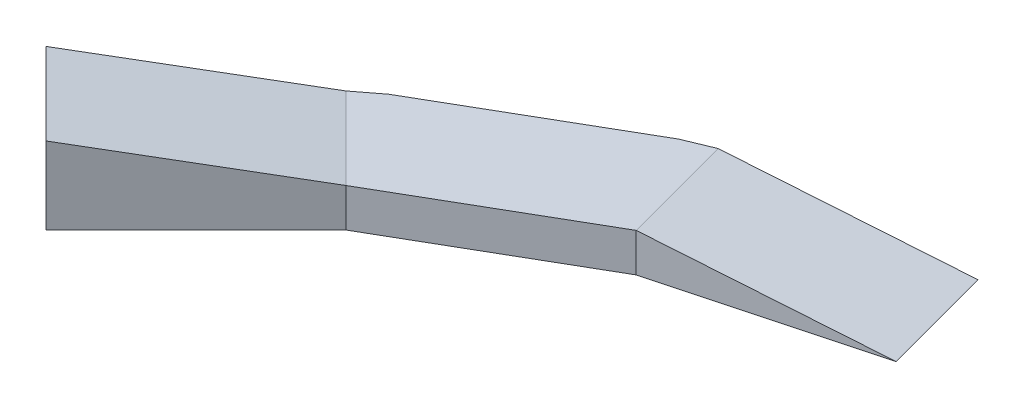
ISO-10303-21;
HEADER;
FILE_DESCRIPTION(('STEP AP214'),'2;1');
FILE_NAME('part.step','',(''),(''),'','','');
FILE_SCHEMA(('AUTOMOTIVE_DESIGN { 1 0 10303 214 1 1 1 1 }'));
ENDSEC;
DATA;
#1=APPLICATION_CONTEXT('core data for automotive mechanical design processes');
#2=APPLICATION_PROTOCOL_DEFINITION('international standard','automotive_design',2000,#1);
#3=PRODUCT_CONTEXT('',#1,'mechanical');
#4=PRODUCT('Part','Part','',(#3));
#5=PRODUCT_RELATED_PRODUCT_CATEGORY('part','',(#4));
#6=PRODUCT_DEFINITION_FORMATION('','',#4);
#7=PRODUCT_DEFINITION_CONTEXT('part definition',#1,'design');
#8=PRODUCT_DEFINITION('design','',#6,#7);
#9=PRODUCT_DEFINITION_SHAPE('','',#8);
#10=(LENGTH_UNIT() NAMED_UNIT(*) SI_UNIT(.MILLI.,.METRE.));
#11=(NAMED_UNIT(*) PLANE_ANGLE_UNIT() SI_UNIT($,.RADIAN.));
#12=(NAMED_UNIT(*) SI_UNIT($,.STERADIAN.) SOLID_ANGLE_UNIT());
#13=UNCERTAINTY_MEASURE_WITH_UNIT(LENGTH_MEASURE(1.E-05),#10,'distance_accuracy_value','');
#14=(GEOMETRIC_REPRESENTATION_CONTEXT(3) GLOBAL_UNCERTAINTY_ASSIGNED_CONTEXT((#13)) GLOBAL_UNIT_ASSIGNED_CONTEXT((#10,
#11,#12)) REPRESENTATION_CONTEXT('',''));
#15=CARTESIAN_POINT('',(0.,0.,0.));
#16=DIRECTION('',(0.,0.,1.));
#17=DIRECTION('',(1.,0.,0.));
#18=AXIS2_PLACEMENT_3D('',#15,#16,#17);
#19=CARTESIAN_POINT('',(-3315.1463530809,-600.,315.085707342127));
#20=DIRECTION('',(-0.608761429008751,0.,-0.793353340291212));
#21=DIRECTION('',(-0.793353340291212,0.,0.608761429008751));
#22=AXIS2_PLACEMENT_3D('',#19,#20,#21);
#23=PLANE('',#22);
#24=DIRECTION('',(0.,1.,0.));
#25=VECTOR('',#24,1.);
#26=CARTESIAN_POINT('',(-3439.41042179279,-600.,410.436880900838));
#27=LINE('',#26,#25);
#28=CARTESIAN_POINT('',(-3439.41042179279,-600.,410.436880900838));
#29=VERTEX_POINT('',#28);
#30=CARTESIAN_POINT('',(-3439.41042179279,-400.,410.436880900831));
#31=VERTEX_POINT('',#30);
#32=EDGE_CURVE('E132',#29,#31,#27,.T.);
#33=ORIENTED_EDGE('',*,*,#32,.T.);
#34=DIRECTION('',(-0.793353340291213,0.,0.60876142900875));
#35=VECTOR('',#34,1.);
#36=CARTESIAN_POINT('',(-3315.14635308086,-400.,315.085707342096));
#37=LINE('',#36,#35);
#38=CARTESIAN_POINT('',(-3315.14635308086,-400.,315.085707342096));
#39=VERTEX_POINT('',#38);
#40=EDGE_CURVE('E126',#39,#31,#37,.T.);
#41=ORIENTED_EDGE('',*,*,#40,.F.);
#42=DIRECTION('',(0.,1.,0.));
#43=VECTOR('',#42,1.);
#44=CARTESIAN_POINT('',(-3315.1463530809,-600.,315.085707342127));
#45=LINE('',#44,#43);
#46=CARTESIAN_POINT('',(-3315.1463530809,-600.,315.085707342127));
#47=VERTEX_POINT('',#46);
#48=EDGE_CURVE('E136',#47,#39,#45,.T.);
#49=ORIENTED_EDGE('',*,*,#48,.F.);
#50=DIRECTION('',(-0.793353340291212,0.,0.608761429008751));
#51=VECTOR('',#50,1.);
#52=CARTESIAN_POINT('',(-3315.1463530809,-600.,315.085707342127));
#53=LINE('',#52,#51);
#54=EDGE_CURVE('E165',#47,#29,#53,.T.);
#55=ORIENTED_EDGE('',*,*,#54,.T.);
#56=EDGE_LOOP('',(#33,#41,#49,#55));
#57=FACE_BOUND('',#56,.T.);
#58=ADVANCED_FACE('F34',(#57),#23,.T.);
#59=CARTESIAN_POINT('',(-1000.,-600.,1.22464679914735E-13));
#60=DIRECTION('',(0.258819045102515,0.,0.96592582628907));
#61=DIRECTION('',(0.96592582628907,0.,-0.258819045102515));
#62=AXIS2_PLACEMENT_3D('',#59,#60,#61);
#63=PLANE('',#62);
#64=DIRECTION('',(0.96592582628907,0.,-0.258819045102515));
#65=VECTOR('',#64,1.);
#66=CARTESIAN_POINT('',(-1000.,-600.,1.22464679914735E-13));
#67=LINE('',#66,#65);
#68=CARTESIAN_POINT('',(-2062.51840891798,-600.,284.700949612766));
#69=VERTEX_POINT('',#68);
#70=CARTESIAN_POINT('',(-1000.,-600.,1.22464679914735E-13));
#71=VERTEX_POINT('',#70);
#72=EDGE_CURVE('E147',#69,#71,#67,.T.);
#73=ORIENTED_EDGE('',*,*,#72,.T.);
#74=DIRECTION('',(-0.950345355874206,0.178885438199983,0.254644270637155));
#75=VECTOR('',#74,1.);
#76=CARTESIAN_POINT('',(-198.845471824454,-750.802945426876,-214.668708837169));
#77=LINE('',#76,#75);
#78=CARTESIAN_POINT('',(-2062.51840891798,-400.,284.700949612765));
#79=VERTEX_POINT('',#78);
#80=EDGE_CURVE('E182',#71,#79,#77,.T.);
#81=ORIENTED_EDGE('',*,*,#80,.T.);
#82=DIRECTION('',(0.,1.,0.));
#83=VECTOR('',#82,1.);
#84=CARTESIAN_POINT('',(-2062.51840891798,-600.,284.700949612766));
#85=LINE('',#84,#83);
#86=EDGE_CURVE('E11',#69,#79,#85,.T.);
#87=ORIENTED_EDGE('',*,*,#86,.F.);
#88=EDGE_LOOP('',(#73,#81,#87));
#89=FACE_BOUND('',#88,.T.);
#90=ADVANCED_FACE('F205',(#89),#63,.T.);
#91=CARTESIAN_POINT('',(-1155.29142706151,-600.,-579.55549577344));
#92=DIRECTION('',(-0.258819045102515,0.,-0.96592582628907));
#93=DIRECTION('',(-0.96592582628907,0.,0.258819045102515));
#94=AXIS2_PLACEMENT_3D('',#91,#92,#93);
#95=PLANE('',#94);
#96=DIRECTION('',(0.,1.,0.));
#97=VECTOR('',#96,1.);
#98=CARTESIAN_POINT('',(-2217.80983597949,-600.,-294.854546160674));
#99=LINE('',#98,#97);
#100=CARTESIAN_POINT('',(-2217.80983597949,-600.,-294.854546160674));
#101=VERTEX_POINT('',#100);
#102=CARTESIAN_POINT('',(-2217.80983597948,-400.,-294.854546160677));
#103=VERTEX_POINT('',#102);
#104=EDGE_CURVE('E38',#101,#103,#99,.T.);
#105=ORIENTED_EDGE('',*,*,#104,.T.);
#106=DIRECTION('',(-0.950345355874206,0.178885438199983,0.254644270637155));
#107=VECTOR('',#106,1.);
#108=CARTESIAN_POINT('',(-354.136898885963,-750.802945426876,-794.224204610611));
#109=LINE('',#108,#107);
#110=CARTESIAN_POINT('',(-1155.29142706151,-600.,-579.555495773442));
#111=VERTEX_POINT('',#110);
#112=EDGE_CURVE('E181',#111,#103,#109,.T.);
#113=ORIENTED_EDGE('',*,*,#112,.F.);
#114=DIRECTION('',(-0.96592582628907,0.,0.258819045102515));
#115=VECTOR('',#114,1.);
#116=CARTESIAN_POINT('',(-1155.29142706151,-600.,-579.55549577344));
#117=LINE('',#116,#115);
#118=EDGE_CURVE('E173',#111,#101,#117,.T.);
#119=ORIENTED_EDGE('',*,*,#118,.T.);
#120=EDGE_LOOP('',(#105,#113,#119));
#121=FACE_BOUND('',#120,.T.);
#122=ADVANCED_FACE('F36',(#121),#95,.T.);
#123=CARTESIAN_POINT('',(-2062.51840891798,-600.,284.700949612766));
#124=DIRECTION('',(0.499999999999995,0.,0.866025403784441));
#125=DIRECTION('',(0.866025403784441,0.,-0.499999999999995));
#126=AXIS2_PLACEMENT_3D('',#123,#124,#125);
#127=PLANE('',#126);
#128=DIRECTION('',(0.866025403784441,0.,-0.499999999999995));
#129=VECTOR('',#128,1.);
#130=CARTESIAN_POINT('',(-2062.51840891798,-400.,284.700949612765));
#131=LINE('',#130,#129);
#132=CARTESIAN_POINT('',(-3015.14635308086,-400.,834.70094961276));
#133=VERTEX_POINT('',#132);
#134=EDGE_CURVE('E187',#133,#79,#131,.T.);
#135=ORIENTED_EDGE('',*,*,#134,.F.);
#136=DIRECTION('',(0.,1.,0.));
#137=VECTOR('',#136,1.);
#138=CARTESIAN_POINT('',(-3015.14635308086,-600.,834.700949612761));
#139=LINE('',#138,#137);
#140=CARTESIAN_POINT('',(-3015.14635308086,-600.,834.700949612761));
#141=VERTEX_POINT('',#140);
#142=EDGE_CURVE('E43',#141,#133,#139,.T.);
#143=ORIENTED_EDGE('',*,*,#142,.F.);
#144=DIRECTION('',(0.866025403784442,0.,-0.499999999999995));
#145=VECTOR('',#144,1.);
#146=CARTESIAN_POINT('',(-2062.51840891798,-600.,284.700949612766));
#147=LINE('',#146,#145);
#148=EDGE_CURVE('E151',#141,#69,#147,.T.);
#149=ORIENTED_EDGE('',*,*,#148,.T.);
#150=ORIENTED_EDGE('',*,*,#86,.T.);
#151=EDGE_LOOP('',(#135,#143,#149,#150));
#152=FACE_BOUND('',#151,.T.);
#153=ADVANCED_FACE('F198',(#152),#127,.T.);
#154=CARTESIAN_POINT('',(-3015.14635308086,-600.,834.700949612761));
#155=DIRECTION('',(0.707106781186548,0.,0.707106781186548));
#156=DIRECTION('',(0.707106781186548,0.,-0.707106781186548));
#157=AXIS2_PLACEMENT_3D('',#154,#155,#156);
#158=PLANE('',#157);
#159=DIRECTION('',(0.695701085237043,-0.178885438199983,-0.695701085237044));
#160=VECTOR('',#159,1.);
#161=CARTESIAN_POINT('',(-3015.14635308086,-400.,834.70094961276));
#162=LINE('',#161,#160);
#163=CARTESIAN_POINT('',(-3792.96381238607,-200.,1612.51840891796));
#164=VERTEX_POINT('',#163);
#165=EDGE_CURVE('E117',#164,#133,#162,.T.);
#166=ORIENTED_EDGE('',*,*,#165,.F.);
#167=DIRECTION('',(0.,1.,0.));
#168=VECTOR('',#167,1.);
#169=CARTESIAN_POINT('',(-3792.96381238607,-600.,1612.51840891796));
#170=LINE('',#169,#168);
#171=CARTESIAN_POINT('',(-3792.96381238607,-600.,1612.51840891796));
#172=VERTEX_POINT('',#171);
#173=EDGE_CURVE('E125',#172,#164,#170,.T.);
#174=ORIENTED_EDGE('',*,*,#173,.F.);
#175=DIRECTION('',(0.707106781186547,0.,-0.707106781186547));
#176=VECTOR('',#175,1.);
#177=CARTESIAN_POINT('',(-3015.14635308086,-600.,834.700949612761));
#178=LINE('',#177,#176);
#179=EDGE_CURVE('E153',#172,#141,#178,.T.);
#180=ORIENTED_EDGE('',*,*,#179,.T.);
#181=ORIENTED_EDGE('',*,*,#142,.T.);
#182=EDGE_LOOP('',(#166,#174,#180,#181));
#183=FACE_BOUND('',#182,.T.);
#184=ADVANCED_FACE('F158',(#183),#158,.T.);
#185=CARTESIAN_POINT('',(-4217.227881098,-600.,1188.25434020604));
#186=DIRECTION('',(-0.707106781186548,0.,0.707106781186548));
#187=DIRECTION('',(0.707106781186548,0.,0.707106781186548));
#188=AXIS2_PLACEMENT_3D('',#185,#186,#187);
#189=PLANE('',#188);
#190=DIRECTION('',(0.707106781186548,0.,0.707106781186547));
#191=VECTOR('',#190,1.);
#192=CARTESIAN_POINT('',(-4217.22788109799,-200.,1188.25434020604));
#193=LINE('',#192,#191);
#194=CARTESIAN_POINT('',(-4217.22788109799,-200.,1188.25434020604));
#195=VERTEX_POINT('',#194);
#196=EDGE_CURVE('E110',#195,#164,#193,.T.);
#197=ORIENTED_EDGE('',*,*,#196,.F.);
#198=DIRECTION('',(0.,1.,0.));
#199=VECTOR('',#198,1.);
#200=CARTESIAN_POINT('',(-4217.227881098,-600.,1188.25434020604));
#201=LINE('',#200,#199);
#202=CARTESIAN_POINT('',(-4217.227881098,-600.,1188.25434020604));
#203=VERTEX_POINT('',#202);
#204=EDGE_CURVE('E123',#203,#195,#201,.T.);
#205=ORIENTED_EDGE('',*,*,#204,.F.);
#206=DIRECTION('',(0.707106781186548,0.,0.707106781186548));
#207=VECTOR('',#206,1.);
#208=CARTESIAN_POINT('',(-4217.227881098,-600.,1188.25434020604));
#209=LINE('',#208,#207);
#210=EDGE_CURVE('E161',#203,#172,#209,.T.);
#211=ORIENTED_EDGE('',*,*,#210,.T.);
#212=ORIENTED_EDGE('',*,*,#173,.T.);
#213=EDGE_LOOP('',(#197,#205,#211,#212));
#214=FACE_BOUND('',#213,.T.);
#215=ADVANCED_FACE('F121',(#214),#189,.T.);
#216=CARTESIAN_POINT('',(-3439.41042179279,-600.,410.436880900838));
#217=DIRECTION('',(-0.707106781186544,0.,-0.707106781186551));
#218=DIRECTION('',(-0.707106781186551,0.,0.707106781186544));
#219=AXIS2_PLACEMENT_3D('',#216,#217,#218);
#220=PLANE('',#219);
#221=DIRECTION('',(0.695701085237043,-0.178885438199983,-0.695701085237044));
#222=VECTOR('',#221,1.);
#223=CARTESIAN_POINT('',(-3439.41042179279,-400.,410.436880900831));
#224=LINE('',#223,#222);
#225=EDGE_CURVE('E107',#195,#31,#224,.T.);
#226=ORIENTED_EDGE('',*,*,#225,.T.);
#227=ORIENTED_EDGE('',*,*,#32,.F.);
#228=DIRECTION('',(-0.707106781186551,0.,0.707106781186544));
#229=VECTOR('',#228,1.);
#230=CARTESIAN_POINT('',(-3439.41042179279,-600.,410.436880900838));
#231=LINE('',#230,#229);
#232=EDGE_CURVE('E131',#29,#203,#231,.T.);
#233=ORIENTED_EDGE('',*,*,#232,.T.);
#234=ORIENTED_EDGE('',*,*,#204,.T.);
#235=EDGE_LOOP('',(#226,#227,#233,#234));
#236=FACE_BOUND('',#235,.T.);
#237=ADVANCED_FACE('F129',(#236),#220,.T.);
#238=CARTESIAN_POINT('',(-2362.51840891798,-600.,-234.914292657897));
#239=DIRECTION('',(-0.5,0.,-0.866025403784438));
#240=DIRECTION('',(-0.866025403784439,0.,0.5));
#241=AXIS2_PLACEMENT_3D('',#238,#239,#240);
#242=PLANE('',#241);
#243=DIRECTION('',(0.866025403784441,0.,-0.499999999999995));
#244=VECTOR('',#243,1.);
#245=CARTESIAN_POINT('',(-2362.51840891797,-400.,-234.914292657899));
#246=LINE('',#245,#244);
#247=CARTESIAN_POINT('',(-2362.51840891797,-400.,-234.914292657899));
#248=VERTEX_POINT('',#247);
#249=EDGE_CURVE('E184',#39,#248,#246,.T.);
#250=ORIENTED_EDGE('',*,*,#249,.T.);
#251=DIRECTION('',(0.,1.,0.));
#252=VECTOR('',#251,1.);
#253=CARTESIAN_POINT('',(-2362.51840891798,-600.,-234.914292657897));
#254=LINE('',#253,#252);
#255=CARTESIAN_POINT('',(-2362.51840891798,-600.,-234.914292657897));
#256=VERTEX_POINT('',#255);
#257=EDGE_CURVE('E141',#256,#248,#254,.T.);
#258=ORIENTED_EDGE('',*,*,#257,.F.);
#259=DIRECTION('',(-0.866025403784438,0.,0.5));
#260=VECTOR('',#259,1.);
#261=CARTESIAN_POINT('',(-2362.51840891798,-600.,-234.914292657897));
#262=LINE('',#261,#260);
#263=EDGE_CURVE('E168',#256,#47,#262,.T.);
#264=ORIENTED_EDGE('',*,*,#263,.T.);
#265=ORIENTED_EDGE('',*,*,#48,.T.);
#266=EDGE_LOOP('',(#250,#258,#264,#265));
#267=FACE_BOUND('',#266,.T.);
#268=ADVANCED_FACE('F220',(#267),#242,.T.);
#269=CARTESIAN_POINT('',(-2217.80983597949,-600.,-294.854546160674));
#270=DIRECTION('',(-0.382683432365093,0.,-0.923879532511286));
#271=DIRECTION('',(-0.923879532511286,0.,0.382683432365093));
#272=AXIS2_PLACEMENT_3D('',#269,#270,#271);
#273=PLANE('',#272);
#274=DIRECTION('',(-0.923879532511286,0.,0.382683432365092));
#275=VECTOR('',#274,1.);
#276=CARTESIAN_POINT('',(-2217.80983597948,-400.,-294.854546160677));
#277=LINE('',#276,#275);
#278=EDGE_CURVE('E189',#103,#248,#277,.T.);
#279=ORIENTED_EDGE('',*,*,#278,.F.);
#280=ORIENTED_EDGE('',*,*,#104,.F.);
#281=DIRECTION('',(-0.923879532511286,0.,0.382683432365093));
#282=VECTOR('',#281,1.);
#283=CARTESIAN_POINT('',(-2217.80983597949,-600.,-294.854546160674));
#284=LINE('',#283,#282);
#285=EDGE_CURVE('E171',#101,#256,#284,.T.);
#286=ORIENTED_EDGE('',*,*,#285,.T.);
#287=ORIENTED_EDGE('',*,*,#257,.T.);
#288=EDGE_LOOP('',(#279,#280,#286,#287));
#289=FACE_BOUND('',#288,.T.);
#290=ADVANCED_FACE('F222',(#289),#273,.T.);
#291=CARTESIAN_POINT('',(0.,-600.,0.));
#292=DIRECTION('',(0.,1.,0.));
#293=DIRECTION('',(0.,0.,1.));
#294=AXIS2_PLACEMENT_3D('',#291,#292,#293);
#295=PLANE('',#294);
#296=ORIENTED_EDGE('',*,*,#118,.F.);
#297=DIRECTION('',(0.258819045102524,0.,0.965925826289067));
#298=VECTOR('',#297,1.);
#299=CARTESIAN_POINT('',(-1000.,-600.,1.22464679914735E-13));
#300=LINE('',#299,#298);
#301=EDGE_CURVE('E175',#111,#71,#300,.T.);
#302=ORIENTED_EDGE('',*,*,#301,.T.);
#303=ORIENTED_EDGE('',*,*,#72,.F.);
#304=ORIENTED_EDGE('',*,*,#148,.F.);
#305=ORIENTED_EDGE('',*,*,#179,.F.);
#306=ORIENTED_EDGE('',*,*,#210,.F.);
#307=ORIENTED_EDGE('',*,*,#232,.F.);
#308=ORIENTED_EDGE('',*,*,#54,.F.);
#309=ORIENTED_EDGE('',*,*,#263,.F.);
#310=ORIENTED_EDGE('',*,*,#285,.F.);
#311=EDGE_LOOP('',(#296,#302,#303,#304,#305,#306,#307,#308,#309,#310));
#312=FACE_BOUND('',#311,.T.);
#313=ADVANCED_FACE('F200',(#312),#295,.F.);
#314=CARTESIAN_POINT('',(-354.136898885963,-750.802945426876,-794.224204610611));
#315=DIRECTION('',(0.172790064704401,0.983869910099907,-0.0462989582976645));
#316=DIRECTION('',(-0.984926117053838,0.172975558808893,0.));
#317=AXIS2_PLACEMENT_3D('',#314,#315,#316);
#318=PLANE('',#317);
#319=ORIENTED_EDGE('',*,*,#80,.F.);
#320=ORIENTED_EDGE('',*,*,#301,.F.);
#321=ORIENTED_EDGE('',*,*,#112,.T.);
#322=DIRECTION('',(0.258819045102515,0.,0.96592582628907));
#323=VECTOR('',#322,1.);
#324=CARTESIAN_POINT('',(-2217.80983597948,-400.,-294.854546160676));
#325=LINE('',#324,#323);
#326=EDGE_CURVE('E178',#103,#79,#325,.T.);
#327=ORIENTED_EDGE('',*,*,#326,.T.);
#328=EDGE_LOOP('',(#319,#320,#321,#327));
#329=FACE_BOUND('',#328,.T.);
#330=ADVANCED_FACE('F203',(#329),#318,.T.);
#331=CARTESIAN_POINT('',(-2362.51840891797,-400.,-234.914292657899));
#332=DIRECTION('',(0.,-1.,0.));
#333=DIRECTION('',(0.,0.,-1.));
#334=AXIS2_PLACEMENT_3D('',#331,#332,#333);
#335=PLANE('',#334);
#336=ORIENTED_EDGE('',*,*,#134,.T.);
#337=ORIENTED_EDGE('',*,*,#326,.F.);
#338=ORIENTED_EDGE('',*,*,#278,.T.);
#339=ORIENTED_EDGE('',*,*,#249,.F.);
#340=ORIENTED_EDGE('',*,*,#40,.T.);
#341=DIRECTION('',(0.707106781186551,0.,0.707106781186544));
#342=VECTOR('',#341,1.);
#343=CARTESIAN_POINT('',(-3439.41042179279,-400.,410.436880900838));
#344=LINE('',#343,#342);
#345=EDGE_CURVE('E113',#31,#133,#344,.T.);
#346=ORIENTED_EDGE('',*,*,#345,.T.);
#347=EDGE_LOOP('',(#336,#337,#338,#339,#340,#346));
#348=FACE_BOUND('',#347,.T.);
#349=ADVANCED_FACE('F196',(#348),#335,.F.);
#350=CARTESIAN_POINT('',(-3439.41042179279,-400.,410.436880900831));
#351=DIRECTION('',(-0.126491106406735,-0.983869910099908,0.126491106406735));
#352=DIRECTION('',(0.,-0.127515342612667,-0.991836598134175));
#353=AXIS2_PLACEMENT_3D('',#350,#351,#352);
#354=PLANE('',#353);
#355=ORIENTED_EDGE('',*,*,#165,.T.);
#356=ORIENTED_EDGE('',*,*,#345,.F.);
#357=ORIENTED_EDGE('',*,*,#225,.F.);
#358=ORIENTED_EDGE('',*,*,#196,.T.);
#359=EDGE_LOOP('',(#355,#356,#357,#358));
#360=FACE_BOUND('',#359,.T.);
#361=ADVANCED_FACE('F109',(#360),#354,.F.);
#362=CLOSED_SHELL('',(#58,#90,#122,#153,#184,#215,#237,#268,#290,#313,#330,#349,#361));
#363=MANIFOLD_SOLID_BREP('B2',#362);
#364=ADVANCED_BREP_SHAPE_REPRESENTATION('',(#18,#363),#14);
#365=SHAPE_DEFINITION_REPRESENTATION(#9,#364);
ENDSEC;
END-ISO-10303-21;
